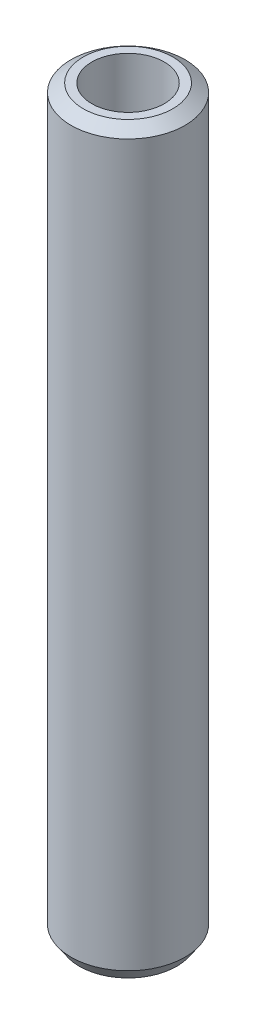
ISO-10303-21;
HEADER;
FILE_DESCRIPTION(('STEP AP214'),'2;1');
FILE_NAME('part.step','',(''),(''),'','','');
FILE_SCHEMA(('AUTOMOTIVE_DESIGN { 1 0 10303 214 1 1 1 1 }'));
ENDSEC;
DATA;
#1=APPLICATION_CONTEXT('core data for automotive mechanical design processes');
#2=APPLICATION_PROTOCOL_DEFINITION('international standard','automotive_design',2000,#1);
#3=PRODUCT_CONTEXT('',#1,'mechanical');
#4=PRODUCT('Part','Part','',(#3));
#5=PRODUCT_RELATED_PRODUCT_CATEGORY('part','',(#4));
#6=PRODUCT_DEFINITION_FORMATION('','',#4);
#7=PRODUCT_DEFINITION_CONTEXT('part definition',#1,'design');
#8=PRODUCT_DEFINITION('design','',#6,#7);
#9=PRODUCT_DEFINITION_SHAPE('','',#8);
#10=(LENGTH_UNIT() NAMED_UNIT(*) SI_UNIT(.MILLI.,.METRE.));
#11=(NAMED_UNIT(*) PLANE_ANGLE_UNIT() SI_UNIT($,.RADIAN.));
#12=(NAMED_UNIT(*) SI_UNIT($,.STERADIAN.) SOLID_ANGLE_UNIT());
#13=UNCERTAINTY_MEASURE_WITH_UNIT(LENGTH_MEASURE(1.E-05),#10,'distance_accuracy_value','');
#14=(GEOMETRIC_REPRESENTATION_CONTEXT(3) GLOBAL_UNCERTAINTY_ASSIGNED_CONTEXT((#13)) GLOBAL_UNIT_ASSIGNED_CONTEXT((#10,
#11,#12)) REPRESENTATION_CONTEXT('',''));
#15=CARTESIAN_POINT('',(0.,0.,0.));
#16=DIRECTION('',(0.,0.,1.));
#17=DIRECTION('',(1.,0.,0.));
#18=AXIS2_PLACEMENT_3D('',#15,#16,#17);
#19=CARTESIAN_POINT('',(0.,162.456042290285,0.));
#20=DIRECTION('',(0.,-1.,0.));
#21=DIRECTION('',(0.,0.,-1.));
#22=AXIS2_PLACEMENT_3D('',#19,#20,#21);
#23=CYLINDRICAL_SURFACE('',#22,12.5);
#24=CARTESIAN_POINT('',(0.,160.624184731217,0.));
#25=DIRECTION('',(0.,1.,0.));
#26=DIRECTION('',(0.,0.,1.));
#27=AXIS2_PLACEMENT_3D('',#24,#25,#26);
#28=CIRCLE('',#27,12.5);
#29=CARTESIAN_POINT('',(0.,160.624184731217,-12.5));
#30=VERTEX_POINT('',#29);
#31=EDGE_CURVE('E50',#30,#30,#28,.F.);
#32=CARTESIAN_POINT('',(0.,2.66598542895566,0.));
#33=DIRECTION('',(0.,1.,0.));
#34=DIRECTION('',(0.,0.,1.));
#35=AXIS2_PLACEMENT_3D('',#32,#33,#34);
#36=CIRCLE('',#35,12.5);
#37=CARTESIAN_POINT('',(0.,2.66598542895563,-12.5));
#38=VERTEX_POINT('',#37);
#39=EDGE_CURVE('E51',#38,#38,#36,.T.);
#40=CARTESIAN_POINT('',(0.,160.624184731217,-12.5));
#41=CARTESIAN_POINT('',(0.,158.978786821818,-12.5));
#42=CARTESIAN_POINT('',(0.,157.33338891242,-12.5));
#43=CARTESIAN_POINT('',(0.,154.042593093622,-12.5));
#44=CARTESIAN_POINT('',(0.,152.397195184224,-12.5));
#45=CARTESIAN_POINT('',(0.,149.106399365427,-12.5));
#46=CARTESIAN_POINT('',(0.,147.461001456028,-12.5));
#47=CARTESIAN_POINT('',(0.,144.170205637231,-12.5));
#48=CARTESIAN_POINT('',(0.,142.524807727833,-12.5));
#49=CARTESIAN_POINT('',(0.,139.234011909035,-12.5));
#50=CARTESIAN_POINT('',(0.,137.588613999637,-12.5));
#51=CARTESIAN_POINT('',(0.,134.29781818084,-12.5));
#52=CARTESIAN_POINT('',(0.,132.652420271441,-12.5));
#53=CARTESIAN_POINT('',(0.,129.361624452644,-12.5));
#54=CARTESIAN_POINT('',(0.,127.716226543246,-12.5));
#55=CARTESIAN_POINT('',(0.,124.425430724449,-12.5));
#56=CARTESIAN_POINT('',(0.,122.78003281505,-12.5));
#57=CARTESIAN_POINT('',(0.,119.489236996253,-12.5));
#58=CARTESIAN_POINT('',(0.,117.843839086854,-12.5));
#59=CARTESIAN_POINT('',(0.,114.553043268057,-12.5));
#60=CARTESIAN_POINT('',(0.,112.907645358659,-12.5));
#61=CARTESIAN_POINT('',(0.,109.616849539862,-12.5));
#62=CARTESIAN_POINT('',(0.,107.971451630463,-12.5));
#63=CARTESIAN_POINT('',(0.,104.680655811666,-12.5));
#64=CARTESIAN_POINT('',(0.,103.035257902267,-12.5));
#65=CARTESIAN_POINT('',(0.,99.7444620834702,-12.5));
#66=CARTESIAN_POINT('',(0.,98.0990641740717,-12.5));
#67=CARTESIAN_POINT('',(0.,94.8082683552746,-12.5));
#68=CARTESIAN_POINT('',(0.,93.162870445876,-12.5));
#69=CARTESIAN_POINT('',(0.,89.8720746270789,-12.5));
#70=CARTESIAN_POINT('',(0.,88.2266767176804,-12.5));
#71=CARTESIAN_POINT('',(0.,84.9358808988833,-12.5));
#72=CARTESIAN_POINT('',(0.,83.2904829894847,-12.5));
#73=CARTESIAN_POINT('',(0.,79.9996871706876,-12.5));
#74=CARTESIAN_POINT('',(0.,78.354289261289,-12.5));
#75=CARTESIAN_POINT('',(0.,75.0634934424919,-12.5));
#76=CARTESIAN_POINT('',(0.,73.4180955330934,-12.5));
#77=CARTESIAN_POINT('',(0.,70.1272997142963,-12.5));
#78=CARTESIAN_POINT('',(0.,68.4819018048977,-12.5));
#79=CARTESIAN_POINT('',(0.,65.1911059861006,-12.5));
#80=CARTESIAN_POINT('',(0.,63.5457080767021,-12.5));
#81=CARTESIAN_POINT('',(0.,60.254912257905,-12.5));
#82=CARTESIAN_POINT('',(0.,58.6095143485064,-12.5));
#83=CARTESIAN_POINT('',(0.,55.3187185297093,-12.5));
#84=CARTESIAN_POINT('',(0.,53.6733206203108,-12.5));
#85=CARTESIAN_POINT('',(0.,50.3825248015137,-12.5));
#86=CARTESIAN_POINT('',(0.,48.7371268921151,-12.5));
#87=CARTESIAN_POINT('',(0.,45.446331073318,-12.5));
#88=CARTESIAN_POINT('',(0.,43.8009331639195,-12.5));
#89=CARTESIAN_POINT('',(0.,40.5101373451223,-12.5));
#90=CARTESIAN_POINT('',(0.,38.8647394357238,-12.5));
#91=CARTESIAN_POINT('',(0.,35.5739436169267,-12.5));
#92=CARTESIAN_POINT('',(0.,33.9285457075281,-12.5));
#93=CARTESIAN_POINT('',(0.,30.637749888731,-12.5));
#94=CARTESIAN_POINT('',(0.,28.9923519793325,-12.5));
#95=CARTESIAN_POINT('',(0.,25.7015561605354,-12.5));
#96=CARTESIAN_POINT('',(0.,24.0561582511368,-12.5));
#97=CARTESIAN_POINT('',(0.,20.7653624323397,-12.5));
#98=CARTESIAN_POINT('',(0.,19.1199645229412,-12.5));
#99=CARTESIAN_POINT('',(0.,15.8291687041441,-12.5));
#100=CARTESIAN_POINT('',(0.,14.1837707947455,-12.5));
#101=CARTESIAN_POINT('',(0.,10.8929749759484,-12.5));
#102=CARTESIAN_POINT('',(0.,9.24757706654985,-12.5));
#103=CARTESIAN_POINT('',(0.,5.95678124775273,-12.5));
#104=CARTESIAN_POINT('',(0.,4.31138333835418,-12.5));
#105=CARTESIAN_POINT('',(0.,2.66598542895563,-12.5));
#106=B_SPLINE_CURVE_WITH_KNOTS('',3,(#40,#41,#42,#43,#44,#45,#46,#47,#48,#49,#50,#51,#52,#53,
#54,#55,#56,#57,#58,#59,#60,#61,#62,#63,#64,#65,#66,#67,#68,#69,#70,#71,#72,#73,#74,#75,#76,#77,
#78,#79,#80,#81,#82,#83,#84,#85,#86,#87,#88,#89,#90,#91,#92,#93,#94,#95,#96,#97,#98,#99,#100,
#101,#102,#103,#104,#105),.UNSPECIFIED.,.F.,.F.,(4,2,2,2,2,2,2,2,2,2,2,2,2,2,2,2,2,2,2,2,2,2,2,
2,2,2,2,2,2,2,2,2,4),(0.,4.93619372819565,9.8723874563913,14.8085811845869,19.7447749127826,
24.6809686409783,29.6171623691739,34.5533560973696,39.4895498255652,44.4257435537609,
49.3619372819565,54.2981310101522,59.2343247383479,64.1705184665435,69.1067121947392,
74.0429059229348,78.9790996511305,83.9152933793262,88.8514871075218,93.7876808357175,
98.7238745639131,103.660068292109,108.596262020304,113.5324557485,118.468649476696,
123.404843204891,128.341036933087,133.277230661283,138.213424389478,143.149618117674,
148.08581184587,153.022005574065,157.958199302261),.UNSPECIFIED.);
#107=EDGE_CURVE('BSEAM39',#30,#38,#106,.T.);
#108=ORIENTED_EDGE('',*,*,#31,.T.);
#109=ORIENTED_EDGE('',*,*,#39,.T.);
#110=ORIENTED_EDGE('',*,*,#107,.T.);
#111=ORIENTED_EDGE('',*,*,#107,.F.);
#112=EDGE_LOOP('',(#108,#110,#109,#111));
#113=FACE_BOUND('',#112,.T.);
#114=ADVANCED_FACE('F39',(#113),#23,.T.);
#115=CARTESIAN_POINT('',(0.,162.456042290285,0.));
#116=DIRECTION('',(0.,1.,0.));
#117=DIRECTION('',(0.,0.,1.));
#118=AXIS2_PLACEMENT_3D('',#115,#116,#117);
#119=PLANE('',#118);
#120=CARTESIAN_POINT('',(0.,162.456042290285,0.));
#121=DIRECTION('',(0.,1.,0.));
#122=DIRECTION('',(0.,0.,1.));
#123=AXIS2_PLACEMENT_3D('',#120,#121,#122);
#124=CIRCLE('',#123,9.83401457104424);
#125=CARTESIAN_POINT('',(0.,162.456042290285,-9.83401457104426));
#126=VERTEX_POINT('',#125);
#127=EDGE_CURVE('E54',#126,#126,#124,.T.);
#128=ORIENTED_EDGE('',*,*,#127,.T.);
#129=EDGE_LOOP('',(#128));
#130=FACE_BOUND('',#129,.T.);
#131=CARTESIAN_POINT('',(0.,162.456042290285,0.));
#132=DIRECTION('',(0.,1.,0.));
#133=DIRECTION('',(0.,0.,1.));
#134=AXIS2_PLACEMENT_3D('',#131,#132,#133);
#135=CIRCLE('',#134,7.94288265644832);
#136=CARTESIAN_POINT('',(0.,162.456042290285,7.94288265644832));
#137=VERTEX_POINT('',#136);
#138=EDGE_CURVE('E58',#137,#137,#135,.T.);
#139=ORIENTED_EDGE('',*,*,#138,.F.);
#140=EDGE_LOOP('',(#139));
#141=FACE_BOUND('',#140,.T.);
#142=ADVANCED_FACE('F69',(#130,#141),#119,.T.);
#143=CARTESIAN_POINT('',(0.,0.,0.));
#144=DIRECTION('',(0.,1.,0.));
#145=DIRECTION('',(0.,0.,1.));
#146=AXIS2_PLACEMENT_3D('',#143,#144,#145);
#147=PLANE('',#146);
#148=CARTESIAN_POINT('',(0.,0.,0.));
#149=DIRECTION('',(0.,1.,0.));
#150=DIRECTION('',(0.,0.,1.));
#151=AXIS2_PLACEMENT_3D('',#148,#149,#150);
#152=CIRCLE('',#151,10.6681424409316);
#153=CARTESIAN_POINT('',(0.,0.,10.6681424409316));
#154=VERTEX_POINT('',#153);
#155=EDGE_CURVE('E10',#154,#154,#152,.F.);
#156=ORIENTED_EDGE('',*,*,#155,.T.);
#157=EDGE_LOOP('',(#156));
#158=FACE_BOUND('',#157,.T.);
#159=CARTESIAN_POINT('',(0.,0.,0.));
#160=DIRECTION('',(0.,1.,0.));
#161=DIRECTION('',(0.,0.,1.));
#162=AXIS2_PLACEMENT_3D('',#159,#160,#161);
#163=CIRCLE('',#162,7.94288265644832);
#164=CARTESIAN_POINT('',(0.,0.,7.94288265644832));
#165=VERTEX_POINT('',#164);
#166=EDGE_CURVE('E63',#165,#165,#163,.T.);
#167=ORIENTED_EDGE('',*,*,#166,.T.);
#168=EDGE_LOOP('',(#167));
#169=FACE_BOUND('',#168,.T.);
#170=ADVANCED_FACE('F75',(#158,#169),#147,.F.);
#171=CARTESIAN_POINT('',(0.,162.456042290285,0.));
#172=DIRECTION('',(0.,-1.,0.));
#173=DIRECTION('',(0.,0.,-1.));
#174=AXIS2_PLACEMENT_3D('',#171,#172,#173);
#175=CYLINDRICAL_SURFACE('',#174,7.94288265644832);
#176=ORIENTED_EDGE('',*,*,#138,.T.);
#177=EDGE_LOOP('',(#176));
#178=FACE_BOUND('',#177,.T.);
#179=ORIENTED_EDGE('',*,*,#166,.F.);
#180=EDGE_LOOP('',(#179));
#181=FACE_BOUND('',#180,.T.);
#182=ADVANCED_FACE('F70',(#178,#181),#175,.F.);
#183=CARTESIAN_POINT('',(0.,162.456042290285,0.));
#184=DIRECTION('',(0.,-1.,0.));
#185=DIRECTION('',(0.,0.,-1.));
#186=AXIS2_PLACEMENT_3D('',#183,#184,#185);
#187=CONICAL_SURFACE('',#186,9.83401457104424,0.968765623683413);
#188=CARTESIAN_POINT('',(0.,160.624184731217,-12.5));
#189=CARTESIAN_POINT('',(0.,160.64326658079,-12.4722293184484));
#190=CARTESIAN_POINT('',(0.,160.662348430364,-12.4444586368968));
#191=CARTESIAN_POINT('',(0.,160.700512129511,-12.3889172737935));
#192=CARTESIAN_POINT('',(0.,160.719593979085,-12.3611465922419));
#193=CARTESIAN_POINT('',(0.,160.757757678232,-12.3056052291387));
#194=CARTESIAN_POINT('',(0.,160.776839527806,-12.277834547587));
#195=CARTESIAN_POINT('',(0.,160.815003226953,-12.2222931844838));
#196=CARTESIAN_POINT('',(0.,160.834085076527,-12.1945225029322));
#197=CARTESIAN_POINT('',(0.,160.872248775674,-12.1389811398289));
#198=CARTESIAN_POINT('',(0.,160.891330625247,-12.1112104582773));
#199=CARTESIAN_POINT('',(0.,160.929494324395,-12.0556690951741));
#200=CARTESIAN_POINT('',(0.,160.948576173968,-12.0278984136224));
#201=CARTESIAN_POINT('',(0.,160.986739873116,-11.9723570505192));
#202=CARTESIAN_POINT('',(0.,161.005821722689,-11.9445863689676));
#203=CARTESIAN_POINT('',(0.,161.043985421837,-11.8890450058643));
#204=CARTESIAN_POINT('',(0.,161.06306727141,-11.8612743243127));
#205=CARTESIAN_POINT('',(0.,161.101230970557,-11.8057329612095));
#206=CARTESIAN_POINT('',(0.,161.120312820131,-11.7779622796578));
#207=CARTESIAN_POINT('',(0.,161.158476519278,-11.7224209165546));
#208=CARTESIAN_POINT('',(0.,161.177558368852,-11.694650235003));
#209=CARTESIAN_POINT('',(0.,161.215722067999,-11.6391088718997));
#210=CARTESIAN_POINT('',(0.,161.234803917573,-11.6113381903481));
#211=CARTESIAN_POINT('',(0.,161.27296761672,-11.5557968272449));
#212=CARTESIAN_POINT('',(0.,161.292049466294,-11.5280261456932));
#213=CARTESIAN_POINT('',(0.,161.330213165441,-11.47248478259));
#214=CARTESIAN_POINT('',(0.,161.349295015015,-11.4447141010384));
#215=CARTESIAN_POINT('',(0.,161.387458714162,-11.3891727379351));
#216=CARTESIAN_POINT('',(0.,161.406540563735,-11.3614020563835));
#217=CARTESIAN_POINT('',(0.,161.444704262883,-11.3058606932803));
#218=CARTESIAN_POINT('',(0.,161.463786112456,-11.2780900117286));
#219=CARTESIAN_POINT('',(0.,161.501949811604,-11.2225486486254));
#220=CARTESIAN_POINT('',(0.,161.521031661177,-11.1947779670738));
#221=CARTESIAN_POINT('',(0.,161.559195360325,-11.1392366039705));
#222=CARTESIAN_POINT('',(0.,161.578277209898,-11.1114659224189));
#223=CARTESIAN_POINT('',(0.,161.616440909045,-11.0559245593157));
#224=CARTESIAN_POINT('',(0.,161.635522758619,-11.028153877764));
#225=CARTESIAN_POINT('',(0.,161.673686457766,-10.9726125146608));
#226=CARTESIAN_POINT('',(0.,161.69276830734,-10.9448418331092));
#227=CARTESIAN_POINT('',(0.,161.730932006487,-10.8893004700059));
#228=CARTESIAN_POINT('',(0.,161.750013856061,-10.8615297884543));
#229=CARTESIAN_POINT('',(0.,161.788177555208,-10.805988425351));
#230=CARTESIAN_POINT('',(0.,161.807259404782,-10.7782177437994));
#231=CARTESIAN_POINT('',(0.,161.845423103929,-10.7226763806962));
#232=CARTESIAN_POINT('',(0.,161.864504953503,-10.6949056991446));
#233=CARTESIAN_POINT('',(0.,161.90266865265,-10.6393643360413));
#234=CARTESIAN_POINT('',(0.,161.921750502223,-10.6115936544897));
#235=CARTESIAN_POINT('',(0.,161.959914201371,-10.5560522913864));
#236=CARTESIAN_POINT('',(0.,161.978996050944,-10.5282816098348));
#237=CARTESIAN_POINT('',(0.,162.017159750092,-10.4727402467316));
#238=CARTESIAN_POINT('',(0.,162.036241599665,-10.44496956518));
#239=CARTESIAN_POINT('',(0.,162.074405298813,-10.3894282020767));
#240=CARTESIAN_POINT('',(0.,162.093487148386,-10.3616575205251));
#241=CARTESIAN_POINT('',(0.,162.131650847533,-10.3061161574218));
#242=CARTESIAN_POINT('',(0.,162.150732697107,-10.2783454758702));
#243=CARTESIAN_POINT('',(0.,162.188896396254,-10.222804112767));
#244=CARTESIAN_POINT('',(0.,162.207978245828,-10.1950334312154));
#245=CARTESIAN_POINT('',(0.,162.246141944975,-10.1394920681121));
#246=CARTESIAN_POINT('',(0.,162.265223794549,-10.1117213865605));
#247=CARTESIAN_POINT('',(0.,162.303387493696,-10.0561800234572));
#248=CARTESIAN_POINT('',(0.,162.32246934327,-10.0284093419056));
#249=CARTESIAN_POINT('',(0.,162.360633042417,-9.97286797880237));
#250=CARTESIAN_POINT('',(0.,162.379714891991,-9.94509729725075));
#251=CARTESIAN_POINT('',(0.,162.417878591138,-9.8895559341475));
#252=CARTESIAN_POINT('',(0.,162.436960440711,-9.86178525259588));
#253=CARTESIAN_POINT('',(0.,162.456042290285,-9.83401457104426));
#254=B_SPLINE_CURVE_WITH_KNOTS('',3,(#188,#189,#190,#191,#192,#193,#194,#195,#196,#197,#198,
#199,#200,#201,#202,#203,#204,#205,#206,#207,#208,#209,#210,#211,#212,#213,#214,#215,#216,#217,
#218,#219,#220,#221,#222,#223,#224,#225,#226,#227,#228,#229,#230,#231,#232,#233,#234,#235,#236,
#237,#238,#239,#240,#241,#242,#243,#244,#245,#246,#247,#248,#249,#250,#251,#252,#253),
.UNSPECIFIED.,.F.,.F.,(4,2,2,2,2,2,2,2,2,2,2,2,2,2,2,2,2,2,2,2,2,2,2,2,2,2,2,2,2,2,2,2,4),(0.,
0.101083874247726,0.202167748495451,0.303251622743176,0.404335496990902,0.505419371238627,
0.606503245486351,0.707587119734077,0.808670993981802,0.909754868229527,1.01083874247725,
1.11192261672499,1.21300649097272,1.31409036522044,1.41517423946817,1.51625811371589,
1.61734198796362,1.71842586221134,1.81950973645907,1.92059361070679,2.02167748495452,
2.12276135920224,2.22384523344998,2.32492910769771,2.42601298194544,2.52709685619316,
2.62818073044089,2.72926460468861,2.83034847893634,2.93143235318406,3.03251622743179,
3.13360010167951,3.23468397592725),.UNSPECIFIED.);
#255=EDGE_CURVE('BSEAM81',#30,#126,#254,.T.);
#256=ORIENTED_EDGE('',*,*,#31,.F.);
#257=ORIENTED_EDGE('',*,*,#127,.F.);
#258=ORIENTED_EDGE('',*,*,#255,.T.);
#259=ORIENTED_EDGE('',*,*,#255,.F.);
#260=EDGE_LOOP('',(#256,#258,#257,#259));
#261=FACE_BOUND('',#260,.T.);
#262=ADVANCED_FACE('F81',(#261),#187,.T.);
#263=CARTESIAN_POINT('',(0.,2.66598542895566,0.));
#264=DIRECTION('',(0.,1.,0.));
#265=DIRECTION('',(0.,0.,1.));
#266=AXIS2_PLACEMENT_3D('',#263,#264,#265);
#267=CONICAL_SURFACE('',#266,12.5,0.602030703111491);
#268=ORIENTED_EDGE('',*,*,#155,.F.);
#269=EDGE_LOOP('',(#268));
#270=FACE_BOUND('',#269,.T.);
#271=ORIENTED_EDGE('',*,*,#39,.F.);
#272=EDGE_LOOP('',(#271));
#273=FACE_BOUND('',#272,.T.);
#274=ADVANCED_FACE('F45',(#270,#273),#267,.T.);
#275=CLOSED_SHELL('',(#114,#142,#170,#182,#262,#274));
#276=MANIFOLD_SOLID_BREP('B2',#275);
#277=ADVANCED_BREP_SHAPE_REPRESENTATION('',(#18,#276),#14);
#278=SHAPE_DEFINITION_REPRESENTATION(#9,#277);
ENDSEC;
END-ISO-10303-21;
